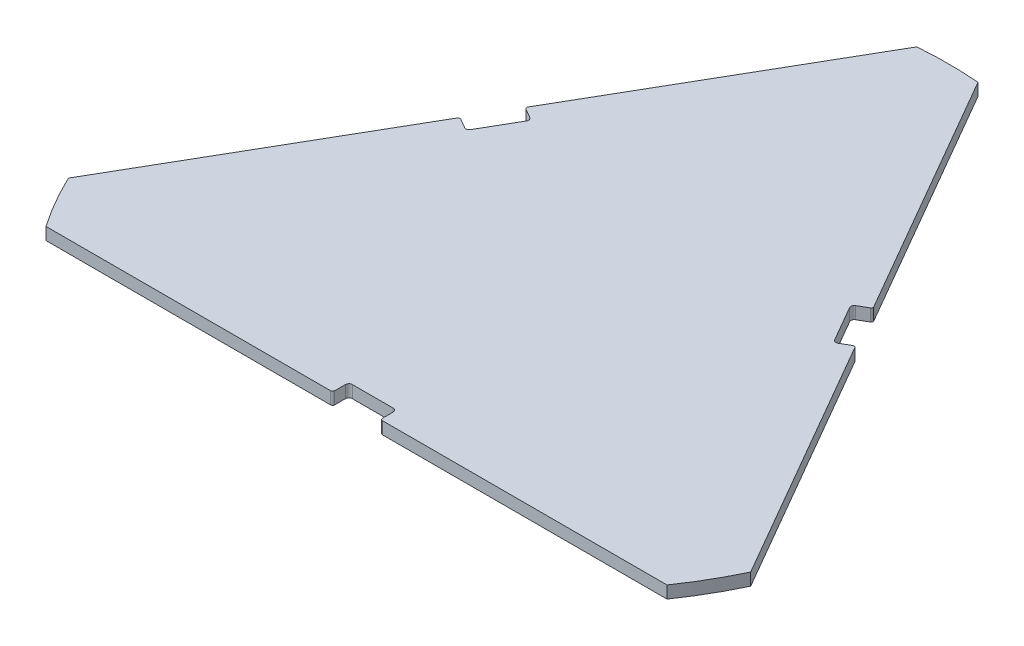
ISO-10303-21;
HEADER;
FILE_DESCRIPTION(('STEP AP214'),'2;1');
FILE_NAME('part.step','',(''),(''),'','','');
FILE_SCHEMA(('AUTOMOTIVE_DESIGN { 1 0 10303 214 1 1 1 1 }'));
ENDSEC;
DATA;
#1=APPLICATION_CONTEXT('core data for automotive mechanical design processes');
#2=APPLICATION_PROTOCOL_DEFINITION('international standard','automotive_design',2000,#1);
#3=PRODUCT_CONTEXT('',#1,'mechanical');
#4=PRODUCT('Part','Part','',(#3));
#5=PRODUCT_RELATED_PRODUCT_CATEGORY('part','',(#4));
#6=PRODUCT_DEFINITION_FORMATION('','',#4);
#7=PRODUCT_DEFINITION_CONTEXT('part definition',#1,'design');
#8=PRODUCT_DEFINITION('design','',#6,#7);
#9=PRODUCT_DEFINITION_SHAPE('','',#8);
#10=(LENGTH_UNIT() NAMED_UNIT(*) SI_UNIT(.MILLI.,.METRE.));
#11=(NAMED_UNIT(*) PLANE_ANGLE_UNIT() SI_UNIT($,.RADIAN.));
#12=(NAMED_UNIT(*) SI_UNIT($,.STERADIAN.) SOLID_ANGLE_UNIT());
#13=UNCERTAINTY_MEASURE_WITH_UNIT(LENGTH_MEASURE(1.E-05),#10,'distance_accuracy_value','');
#14=(GEOMETRIC_REPRESENTATION_CONTEXT(3) GLOBAL_UNCERTAINTY_ASSIGNED_CONTEXT((#13)) GLOBAL_UNIT_ASSIGNED_CONTEXT((#10,
#11,#12)) REPRESENTATION_CONTEXT('',''));
#15=CARTESIAN_POINT('',(0.,0.,0.));
#16=DIRECTION('',(0.,0.,1.));
#17=DIRECTION('',(1.,0.,0.));
#18=AXIS2_PLACEMENT_3D('',#15,#16,#17);
#19=CARTESIAN_POINT('',(-1.86723606306923E-07,18.,-1.07804529192457E-07));
#20=DIRECTION('',(0.,-1.,0.));
#21=DIRECTION('',(0.,0.,-1.));
#22=AXIS2_PLACEMENT_3D('',#19,#20,#21);
#23=CYLINDRICAL_SURFACE('',#22,553.647225230099);
#24=CARTESIAN_POINT('',(-1.86723606306923E-07,0.,-1.07804529192457E-07));
#25=DIRECTION('',(0.,1.,0.));
#26=DIRECTION('',(0.,0.,1.));
#27=AXIS2_PLACEMENT_3D('',#24,#25,#26);
#28=CIRCLE('',#27,553.647225230099);
#29=CARTESIAN_POINT('',(-500.355543515485,0.,237.001224077152));
#30=VERTEX_POINT('',#29);
#31=CARTESIAN_POINT('',(-455.426852277141,0.,314.819999892197));
#32=VERTEX_POINT('',#31);
#33=EDGE_CURVE('E259',#30,#32,#28,.T.);
#34=ORIENTED_EDGE('',*,*,#33,.T.);
#35=DIRECTION('',(0.,-1.,0.));
#36=VECTOR('',#35,1.);
#37=CARTESIAN_POINT('',(-455.426852277141,18.,314.819999892197));
#38=LINE('',#37,#36);
#39=CARTESIAN_POINT('',(-455.426852277141,18.,314.819999892197));
#40=VERTEX_POINT('',#39);
#41=EDGE_CURVE('E240',#40,#32,#38,.T.);
#42=ORIENTED_EDGE('',*,*,#41,.F.);
#43=CARTESIAN_POINT('',(-1.86723606306923E-07,18.,-1.07804529192457E-07));
#44=DIRECTION('',(0.,1.,0.));
#45=DIRECTION('',(0.,0.,1.));
#46=AXIS2_PLACEMENT_3D('',#43,#44,#45);
#47=CIRCLE('',#46,553.647225230099);
#48=CARTESIAN_POINT('',(-500.355543515485,18.,237.001224077152));
#49=VERTEX_POINT('',#48);
#50=EDGE_CURVE('E247',#49,#40,#47,.T.);
#51=ORIENTED_EDGE('',*,*,#50,.F.);
#52=DIRECTION('',(0.,-1.,0.));
#53=VECTOR('',#52,1.);
#54=CARTESIAN_POINT('',(-500.355543515485,18.,237.001224077152));
#55=LINE('',#54,#53);
#56=EDGE_CURVE('E386',#49,#30,#55,.T.);
#57=ORIENTED_EDGE('',*,*,#56,.T.);
#58=EDGE_LOOP('',(#34,#42,#51,#57));
#59=FACE_BOUND('',#58,.T.);
#60=ADVANCED_FACE('F39',(#59),#23,.T.);
#61=CARTESIAN_POINT('',(-455.426852277141,18.,314.819999892197));
#62=DIRECTION('',(0.,0.,-1.));
#63=DIRECTION('',(-1.,0.,0.));
#64=AXIS2_PLACEMENT_3D('',#61,#62,#63);
#65=PLANE('',#64);
#66=DIRECTION('',(1.,0.,0.));
#67=VECTOR('',#66,1.);
#68=CARTESIAN_POINT('',(-455.426852277141,0.,314.819999892197));
#69=LINE('',#68,#67);
#70=CARTESIAN_POINT('',(-38.0000001867224,0.,314.819999892197));
#71=VERTEX_POINT('',#70);
#72=EDGE_CURVE('E433',#32,#71,#69,.T.);
#73=ORIENTED_EDGE('',*,*,#72,.T.);
#74=DIRECTION('',(0.,-1.,0.));
#75=VECTOR('',#74,1.);
#76=CARTESIAN_POINT('',(-38.0000001867224,18.,314.819999892197));
#77=LINE('',#76,#75);
#78=CARTESIAN_POINT('',(-38.0000001867224,18.,314.819999892197));
#79=VERTEX_POINT('',#78);
#80=EDGE_CURVE('E243',#79,#71,#77,.T.);
#81=ORIENTED_EDGE('',*,*,#80,.F.);
#82=DIRECTION('',(1.,0.,0.));
#83=VECTOR('',#82,1.);
#84=CARTESIAN_POINT('',(-455.426852277141,18.,314.819999892197));
#85=LINE('',#84,#83);
#86=EDGE_CURVE('E236',#40,#79,#85,.T.);
#87=ORIENTED_EDGE('',*,*,#86,.F.);
#88=ORIENTED_EDGE('',*,*,#41,.T.);
#89=EDGE_LOOP('',(#73,#81,#87,#88));
#90=FACE_BOUND('',#89,.T.);
#91=ADVANCED_FACE('F238',(#90),#65,.F.);
#92=CARTESIAN_POINT('',(-38.0000001867224,18.,311.819999892197));
#93=DIRECTION('',(0.,-1.,0.));
#94=DIRECTION('',(0.,0.,-1.));
#95=AXIS2_PLACEMENT_3D('',#92,#93,#94);
#96=CYLINDRICAL_SURFACE('',#95,3.00000000000011);
#97=CARTESIAN_POINT('',(-38.0000001867224,0.,311.819999892197));
#98=DIRECTION('',(0.,1.,0.));
#99=DIRECTION('',(0.,0.,1.));
#100=AXIS2_PLACEMENT_3D('',#97,#98,#99);
#101=CIRCLE('',#100,3.00000000000011);
#102=CARTESIAN_POINT('',(-35.0000001867223,0.,311.819999892197));
#103=VERTEX_POINT('',#102);
#104=EDGE_CURVE('E344',#71,#103,#101,.T.);
#105=ORIENTED_EDGE('',*,*,#104,.T.);
#106=DIRECTION('',(0.,-1.,0.));
#107=VECTOR('',#106,1.);
#108=CARTESIAN_POINT('',(-35.0000001867223,18.,311.819999892197));
#109=LINE('',#108,#107);
#110=CARTESIAN_POINT('',(-35.0000001867223,18.,311.819999892197));
#111=VERTEX_POINT('',#110);
#112=EDGE_CURVE('E264',#111,#103,#109,.T.);
#113=ORIENTED_EDGE('',*,*,#112,.F.);
#114=CARTESIAN_POINT('',(-38.0000001867224,18.,311.819999892197));
#115=DIRECTION('',(0.,1.,0.));
#116=DIRECTION('',(0.,0.,1.));
#117=AXIS2_PLACEMENT_3D('',#114,#115,#116);
#118=CIRCLE('',#117,3.00000000000011);
#119=EDGE_CURVE('E246',#79,#111,#118,.T.);
#120=ORIENTED_EDGE('',*,*,#119,.F.);
#121=ORIENTED_EDGE('',*,*,#80,.T.);
#122=EDGE_LOOP('',(#105,#113,#120,#121));
#123=FACE_BOUND('',#122,.T.);
#124=ADVANCED_FACE('F478',(#123),#96,.T.);
#125=CARTESIAN_POINT('',(-35.0000001867223,18.,311.819999892197));
#126=DIRECTION('',(-1.,0.,0.));
#127=DIRECTION('',(0.,0.,1.));
#128=AXIS2_PLACEMENT_3D('',#125,#126,#127);
#129=PLANE('',#128);
#130=DIRECTION('',(0.,0.,-1.));
#131=VECTOR('',#130,1.);
#132=CARTESIAN_POINT('',(-35.0000001867223,0.,311.819999892197));
#133=LINE('',#132,#131);
#134=CARTESIAN_POINT('',(-35.0000001867223,0.,295.999999892197));
#135=VERTEX_POINT('',#134);
#136=EDGE_CURVE('E340',#103,#135,#133,.T.);
#137=ORIENTED_EDGE('',*,*,#136,.T.);
#138=DIRECTION('',(0.,-1.,0.));
#139=VECTOR('',#138,1.);
#140=CARTESIAN_POINT('',(-35.0000001867223,18.,295.999999892197));
#141=LINE('',#140,#139);
#142=CARTESIAN_POINT('',(-35.0000001867223,18.,295.999999892197));
#143=VERTEX_POINT('',#142);
#144=EDGE_CURVE('E54',#135,#143,#141,.F.);
#145=ORIENTED_EDGE('',*,*,#144,.T.);
#146=DIRECTION('',(0.,0.,-1.));
#147=VECTOR('',#146,1.);
#148=CARTESIAN_POINT('',(-35.0000001867223,18.,311.819999892197));
#149=LINE('',#148,#147);
#150=EDGE_CURVE('E430',#111,#143,#149,.T.);
#151=ORIENTED_EDGE('',*,*,#150,.F.);
#152=ORIENTED_EDGE('',*,*,#112,.T.);
#153=EDGE_LOOP('',(#137,#145,#151,#152));
#154=FACE_BOUND('',#153,.T.);
#155=ADVANCED_FACE('F429',(#154),#129,.F.);
#156=CARTESIAN_POINT('',(-35.0000001867223,18.,290.999999892197));
#157=DIRECTION('',(0.,0.,-1.));
#158=DIRECTION('',(-1.,0.,0.));
#159=AXIS2_PLACEMENT_3D('',#156,#157,#158);
#160=PLANE('',#159);
#161=DIRECTION('',(1.,0.,0.));
#162=VECTOR('',#161,1.);
#163=CARTESIAN_POINT('',(-35.0000001867223,0.,290.999999892197));
#164=LINE('',#163,#162);
#165=CARTESIAN_POINT('',(-30.0000001867223,0.,290.999999892197));
#166=VERTEX_POINT('',#165);
#167=CARTESIAN_POINT('',(29.9999998132779,0.,290.999999892197));
#168=VERTEX_POINT('',#167);
#169=EDGE_CURVE('E334',#166,#168,#164,.T.);
#170=ORIENTED_EDGE('',*,*,#169,.T.);
#171=DIRECTION('',(0.,-1.,0.));
#172=VECTOR('',#171,1.);
#173=CARTESIAN_POINT('',(29.9999998132779,18.,290.999999892197));
#174=LINE('',#173,#172);
#175=CARTESIAN_POINT('',(29.9999998132779,18.,290.999999892197));
#176=VERTEX_POINT('',#175);
#177=EDGE_CURVE('E291',#168,#176,#174,.F.);
#178=ORIENTED_EDGE('',*,*,#177,.T.);
#179=DIRECTION('',(1.,0.,0.));
#180=VECTOR('',#179,1.);
#181=CARTESIAN_POINT('',(-35.0000001867223,18.,290.999999892197));
#182=LINE('',#181,#180);
#183=CARTESIAN_POINT('',(-30.0000001867223,18.,290.999999892197));
#184=VERTEX_POINT('',#183);
#185=EDGE_CURVE('E319',#184,#176,#182,.T.);
#186=ORIENTED_EDGE('',*,*,#185,.F.);
#187=DIRECTION('',(0.,-1.,0.));
#188=VECTOR('',#187,1.);
#189=CARTESIAN_POINT('',(-30.0000001867223,0.,290.999999892197));
#190=LINE('',#189,#188);
#191=EDGE_CURVE('E288',#184,#166,#190,.T.);
#192=ORIENTED_EDGE('',*,*,#191,.T.);
#193=EDGE_LOOP('',(#170,#178,#186,#192));
#194=FACE_BOUND('',#193,.T.);
#195=ADVANCED_FACE('F338',(#194),#160,.F.);
#196=CARTESIAN_POINT('',(34.9999998132779,18.,290.999999892197));
#197=DIRECTION('',(1.,0.,0.));
#198=DIRECTION('',(0.,0.,-1.));
#199=AXIS2_PLACEMENT_3D('',#196,#197,#198);
#200=PLANE('',#199);
#201=DIRECTION('',(0.,0.,1.));
#202=VECTOR('',#201,1.);
#203=CARTESIAN_POINT('',(34.9999998132779,18.,290.999999892197));
#204=LINE('',#203,#202);
#205=CARTESIAN_POINT('',(34.9999998132779,18.,295.999999892197));
#206=VERTEX_POINT('',#205);
#207=CARTESIAN_POINT('',(34.9999998132779,18.,311.819999892198));
#208=VERTEX_POINT('',#207);
#209=EDGE_CURVE('E316',#206,#208,#204,.T.);
#210=ORIENTED_EDGE('',*,*,#209,.F.);
#211=DIRECTION('',(0.,-1.,0.));
#212=VECTOR('',#211,1.);
#213=CARTESIAN_POINT('',(34.9999998132779,0.,295.999999892197));
#214=LINE('',#213,#212);
#215=CARTESIAN_POINT('',(34.9999998132779,0.,295.999999892197));
#216=VERTEX_POINT('',#215);
#217=EDGE_CURVE('E285',#206,#216,#214,.T.);
#218=ORIENTED_EDGE('',*,*,#217,.T.);
#219=DIRECTION('',(0.,0.,1.));
#220=VECTOR('',#219,1.);
#221=CARTESIAN_POINT('',(34.9999998132779,0.,290.999999892197));
#222=LINE('',#221,#220);
#223=CARTESIAN_POINT('',(34.9999998132779,0.,311.819999892198));
#224=VERTEX_POINT('',#223);
#225=EDGE_CURVE('E336',#216,#224,#222,.T.);
#226=ORIENTED_EDGE('',*,*,#225,.T.);
#227=DIRECTION('',(0.,-1.,0.));
#228=VECTOR('',#227,1.);
#229=CARTESIAN_POINT('',(34.9999998132779,18.,311.819999892198));
#230=LINE('',#229,#228);
#231=EDGE_CURVE('E327',#208,#224,#230,.T.);
#232=ORIENTED_EDGE('',*,*,#231,.F.);
#233=EDGE_LOOP('',(#210,#218,#226,#232));
#234=FACE_BOUND('',#233,.T.);
#235=ADVANCED_FACE('F324',(#234),#200,.F.);
#236=CARTESIAN_POINT('',(37.999999813278,18.,311.819999892198));
#237=DIRECTION('',(0.,-1.,0.));
#238=DIRECTION('',(0.,0.,-1.));
#239=AXIS2_PLACEMENT_3D('',#236,#237,#238);
#240=CYLINDRICAL_SURFACE('',#239,3.00000000000011);
#241=CARTESIAN_POINT('',(37.999999813278,0.,311.819999892198));
#242=DIRECTION('',(0.,1.,0.));
#243=DIRECTION('',(0.,0.,1.));
#244=AXIS2_PLACEMENT_3D('',#241,#242,#243);
#245=CIRCLE('',#244,3.00000000000011);
#246=CARTESIAN_POINT('',(37.999999813278,0.,314.819999892198));
#247=VERTEX_POINT('',#246);
#248=EDGE_CURVE('E342',#224,#247,#245,.T.);
#249=ORIENTED_EDGE('',*,*,#248,.T.);
#250=DIRECTION('',(0.,-1.,0.));
#251=VECTOR('',#250,1.);
#252=CARTESIAN_POINT('',(37.999999813278,18.,314.819999892198));
#253=LINE('',#252,#251);
#254=CARTESIAN_POINT('',(37.999999813278,18.,314.819999892198));
#255=VERTEX_POINT('',#254);
#256=EDGE_CURVE('E424',#255,#247,#253,.T.);
#257=ORIENTED_EDGE('',*,*,#256,.F.);
#258=CARTESIAN_POINT('',(37.999999813278,18.,311.819999892198));
#259=DIRECTION('',(0.,1.,0.));
#260=DIRECTION('',(0.,0.,1.));
#261=AXIS2_PLACEMENT_3D('',#258,#259,#260);
#262=CIRCLE('',#261,3.00000000000011);
#263=EDGE_CURVE('E329',#208,#255,#262,.T.);
#264=ORIENTED_EDGE('',*,*,#263,.F.);
#265=ORIENTED_EDGE('',*,*,#231,.T.);
#266=EDGE_LOOP('',(#249,#257,#264,#265));
#267=FACE_BOUND('',#266,.T.);
#268=ADVANCED_FACE('F643',(#267),#240,.T.);
#269=CARTESIAN_POINT('',(37.999999813278,18.,314.819999892198));
#270=DIRECTION('',(0.,0.,-1.));
#271=DIRECTION('',(-1.,0.,0.));
#272=AXIS2_PLACEMENT_3D('',#269,#270,#271);
#273=PLANE('',#272);
#274=DIRECTION('',(1.,0.,0.));
#275=VECTOR('',#274,1.);
#276=CARTESIAN_POINT('',(37.999999813278,0.,314.819999892198));
#277=LINE('',#276,#275);
#278=CARTESIAN_POINT('',(455.426851903696,0.,314.819999892198));
#279=VERTEX_POINT('',#278);
#280=EDGE_CURVE('E349',#247,#279,#277,.T.);
#281=ORIENTED_EDGE('',*,*,#280,.T.);
#282=DIRECTION('',(0.,-1.,0.));
#283=VECTOR('',#282,1.);
#284=CARTESIAN_POINT('',(455.426851903696,18.,314.819999892198));
#285=LINE('',#284,#283);
#286=CARTESIAN_POINT('',(455.426851903696,18.,314.819999892198));
#287=VERTEX_POINT('',#286);
#288=EDGE_CURVE('E421',#287,#279,#285,.T.);
#289=ORIENTED_EDGE('',*,*,#288,.F.);
#290=DIRECTION('',(1.,0.,0.));
#291=VECTOR('',#290,1.);
#292=CARTESIAN_POINT('',(37.999999813278,18.,314.819999892198));
#293=LINE('',#292,#291);
#294=EDGE_CURVE('E472',#255,#287,#293,.T.);
#295=ORIENTED_EDGE('',*,*,#294,.F.);
#296=ORIENTED_EDGE('',*,*,#256,.T.);
#297=EDGE_LOOP('',(#281,#289,#295,#296));
#298=FACE_BOUND('',#297,.T.);
#299=ADVANCED_FACE('F746',(#298),#273,.F.);
#300=CARTESIAN_POINT('',(-1.86723606306923E-07,18.,-1.07804529192457E-07));
#301=DIRECTION('',(0.,-1.,0.));
#302=DIRECTION('',(0.,0.,-1.));
#303=AXIS2_PLACEMENT_3D('',#300,#301,#302);
#304=CYLINDRICAL_SURFACE('',#303,553.647225230101);
#305=CARTESIAN_POINT('',(-1.86723606306923E-07,0.,-1.07804529192457E-07));
#306=DIRECTION('',(0.,1.,0.));
#307=DIRECTION('',(0.,0.,1.));
#308=AXIS2_PLACEMENT_3D('',#305,#306,#307);
#309=CIRCLE('',#308,553.647225230101);
#310=CARTESIAN_POINT('',(500.355543579487,0.,237.001223153615));
#311=VERTEX_POINT('',#310);
#312=EDGE_CURVE('E351',#279,#311,#309,.T.);
#313=ORIENTED_EDGE('',*,*,#312,.T.);
#314=DIRECTION('',(0.,-1.,0.));
#315=VECTOR('',#314,1.);
#316=CARTESIAN_POINT('',(500.355543579487,18.,237.001223153615));
#317=LINE('',#316,#315);
#318=CARTESIAN_POINT('',(500.355543579487,18.,237.001223153615));
#319=VERTEX_POINT('',#318);
#320=EDGE_CURVE('E418',#319,#311,#317,.T.);
#321=ORIENTED_EDGE('',*,*,#320,.F.);
#322=CARTESIAN_POINT('',(-1.86723606306923E-07,18.,-1.07804529192457E-07));
#323=DIRECTION('',(0.,1.,0.));
#324=DIRECTION('',(0.,0.,1.));
#325=AXIS2_PLACEMENT_3D('',#322,#323,#324);
#326=CIRCLE('',#325,553.647225230101);
#327=EDGE_CURVE('E470',#287,#319,#326,.T.);
#328=ORIENTED_EDGE('',*,*,#327,.F.);
#329=ORIENTED_EDGE('',*,*,#288,.T.);
#330=EDGE_LOOP('',(#313,#321,#328,#329));
#331=FACE_BOUND('',#330,.T.);
#332=ADVANCED_FACE('F736',(#331),#304,.T.);
#333=CARTESIAN_POINT('',(500.355543579487,18.,237.001223153615));
#334=DIRECTION('',(-0.866025403784439,0.,0.5));
#335=DIRECTION('',(0.5,0.,0.866025403784439));
#336=AXIS2_PLACEMENT_3D('',#333,#334,#335);
#337=PLANE('',#336);
#338=DIRECTION('',(-0.5,0.,-0.866025403784439));
#339=VECTOR('',#338,1.);
#340=CARTESIAN_POINT('',(500.355543579487,0.,237.001223153615));
#341=LINE('',#340,#339);
#342=CARTESIAN_POINT('',(291.642117601455,0.,-124.501034862104));
#343=VERTEX_POINT('',#342);
#344=EDGE_CURVE('E353',#311,#343,#341,.T.);
#345=ORIENTED_EDGE('',*,*,#344,.T.);
#346=DIRECTION('',(0.,-1.,0.));
#347=VECTOR('',#346,1.);
#348=CARTESIAN_POINT('',(291.642117601455,18.,-124.501034862104));
#349=LINE('',#348,#347);
#350=CARTESIAN_POINT('',(291.642117601455,18.,-124.501034862104));
#351=VERTEX_POINT('',#350);
#352=EDGE_CURVE('E415',#351,#343,#349,.T.);
#353=ORIENTED_EDGE('',*,*,#352,.F.);
#354=DIRECTION('',(-0.5,0.,-0.866025403784439));
#355=VECTOR('',#354,1.);
#356=CARTESIAN_POINT('',(500.355543579487,18.,237.001223153615));
#357=LINE('',#356,#355);
#358=EDGE_CURVE('E468',#319,#351,#357,.T.);
#359=ORIENTED_EDGE('',*,*,#358,.F.);
#360=ORIENTED_EDGE('',*,*,#320,.T.);
#361=EDGE_LOOP('',(#345,#353,#359,#360));
#362=FACE_BOUND('',#361,.T.);
#363=ADVANCED_FACE('F726',(#362),#337,.F.);
#364=CARTESIAN_POINT('',(289.044041390393,18.,-123.001034861597));
#365=DIRECTION('',(0.,-1.,0.));
#366=DIRECTION('',(0.,0.,-1.));
#367=AXIS2_PLACEMENT_3D('',#364,#365,#366);
#368=CYLINDRICAL_SURFACE('',#367,3.00000000000039);
#369=CARTESIAN_POINT('',(289.044041390393,0.,-123.001034861597));
#370=DIRECTION('',(0.,1.,0.));
#371=DIRECTION('',(0.,0.,1.));
#372=AXIS2_PLACEMENT_3D('',#369,#370,#371);
#373=CIRCLE('',#372,3.00000000000039);
#374=CARTESIAN_POINT('',(287.544041390393,0.,-125.599111072951));
#375=VERTEX_POINT('',#374);
#376=EDGE_CURVE('E355',#343,#375,#373,.T.);
#377=ORIENTED_EDGE('',*,*,#376,.T.);
#378=DIRECTION('',(0.,-1.,0.));
#379=VECTOR('',#378,1.);
#380=CARTESIAN_POINT('',(287.544041390393,18.,-125.599111072951));
#381=LINE('',#380,#379);
#382=CARTESIAN_POINT('',(287.544041390393,18.,-125.599111072951));
#383=VERTEX_POINT('',#382);
#384=EDGE_CURVE('E412',#383,#375,#381,.T.);
#385=ORIENTED_EDGE('',*,*,#384,.F.);
#386=CARTESIAN_POINT('',(289.044041390393,18.,-123.001034861597));
#387=DIRECTION('',(0.,1.,0.));
#388=DIRECTION('',(0.,0.,1.));
#389=AXIS2_PLACEMENT_3D('',#386,#387,#388);
#390=CIRCLE('',#389,3.00000000000039);
#391=EDGE_CURVE('E466',#351,#383,#390,.T.);
#392=ORIENTED_EDGE('',*,*,#391,.F.);
#393=ORIENTED_EDGE('',*,*,#352,.T.);
#394=EDGE_LOOP('',(#377,#385,#392,#393));
#395=FACE_BOUND('',#394,.T.);
#396=ADVANCED_FACE('F631',(#395),#368,.T.);
#397=CARTESIAN_POINT('',(287.544041390393,18.,-125.599111072951));
#398=DIRECTION('',(0.5,0.,0.866025403784439));
#399=DIRECTION('',(0.866025403784439,0.,-0.5));
#400=AXIS2_PLACEMENT_3D('',#397,#398,#399);
#401=PLANE('',#400);
#402=DIRECTION('',(-0.866025403784439,0.,0.5));
#403=VECTOR('',#402,1.);
#404=CARTESIAN_POINT('',(287.544041390393,0.,-125.599111072951));
#405=LINE('',#404,#403);
#406=CARTESIAN_POINT('',(273.843519262953,0.,-117.689110934635));
#407=VERTEX_POINT('',#406);
#408=EDGE_CURVE('E357',#375,#407,#405,.T.);
#409=ORIENTED_EDGE('',*,*,#408,.T.);
#410=DIRECTION('',(0.,-1.,0.));
#411=VECTOR('',#410,1.);
#412=CARTESIAN_POINT('',(273.843519262953,18.,-117.689110934635));
#413=LINE('',#412,#411);
#414=CARTESIAN_POINT('',(273.843519262953,18.,-117.689110934635));
#415=VERTEX_POINT('',#414);
#416=EDGE_CURVE('E280',#407,#415,#413,.F.);
#417=ORIENTED_EDGE('',*,*,#416,.T.);
#418=DIRECTION('',(-0.866025403784439,0.,0.5));
#419=VECTOR('',#418,1.);
#420=CARTESIAN_POINT('',(287.544041390393,18.,-125.599111072951));
#421=LINE('',#420,#419);
#422=EDGE_CURVE('E463',#383,#415,#421,.T.);
#423=ORIENTED_EDGE('',*,*,#422,.F.);
#424=ORIENTED_EDGE('',*,*,#384,.T.);
#425=EDGE_LOOP('',(#409,#417,#423,#424));
#426=FACE_BOUND('',#425,.T.);
#427=ADVANCED_FACE('F621',(#426),#401,.F.);
#428=CARTESIAN_POINT('',(269.513392244031,18.,-115.189110934635));
#429=DIRECTION('',(-0.866025403784439,0.,0.5));
#430=DIRECTION('',(0.5,0.,0.866025403784439));
#431=AXIS2_PLACEMENT_3D('',#428,#429,#430);
#432=PLANE('',#431);
#433=DIRECTION('',(-0.5,0.,-0.866025403784439));
#434=VECTOR('',#433,1.);
#435=CARTESIAN_POINT('',(269.513392244031,18.,-115.189110934635));
#436=LINE('',#435,#434);
#437=CARTESIAN_POINT('',(267.013392244031,18.,-119.519237953557));
#438=VERTEX_POINT('',#437);
#439=CARTESIAN_POINT('',(237.013392244032,18.,-171.480762180622));
#440=VERTEX_POINT('',#439);
#441=EDGE_CURVE('E460',#438,#440,#436,.T.);
#442=ORIENTED_EDGE('',*,*,#441,.F.);
#443=DIRECTION('',(0.,-1.,0.));
#444=VECTOR('',#443,1.);
#445=CARTESIAN_POINT('',(267.013392244031,0.,-119.519237953557));
#446=LINE('',#445,#444);
#447=CARTESIAN_POINT('',(267.013392244031,0.,-119.519237953557));
#448=VERTEX_POINT('',#447);
#449=EDGE_CURVE('E277',#438,#448,#446,.T.);
#450=ORIENTED_EDGE('',*,*,#449,.T.);
#451=DIRECTION('',(-0.5,0.,-0.866025403784439));
#452=VECTOR('',#451,1.);
#453=CARTESIAN_POINT('',(269.513392244031,0.,-115.189110934635));
#454=LINE('',#453,#452);
#455=CARTESIAN_POINT('',(237.013392244032,0.,-171.480762180622));
#456=VERTEX_POINT('',#455);
#457=EDGE_CURVE('E360',#448,#456,#454,.T.);
#458=ORIENTED_EDGE('',*,*,#457,.T.);
#459=DIRECTION('',(0.,-1.,0.));
#460=VECTOR('',#459,1.);
#461=CARTESIAN_POINT('',(237.013392244032,18.,-171.480762180622));
#462=LINE('',#461,#460);
#463=EDGE_CURVE('E275',#456,#440,#462,.F.);
#464=ORIENTED_EDGE('',*,*,#463,.T.);
#465=EDGE_LOOP('',(#442,#450,#458,#464));
#466=FACE_BOUND('',#465,.T.);
#467=ADVANCED_FACE('F609',(#466),#432,.F.);
#468=CARTESIAN_POINT('',(234.513392244032,18.,-175.810889199544));
#469=DIRECTION('',(-0.5,0.,-0.866025403784439));
#470=DIRECTION('',(-0.866025403784439,0.,0.5));
#471=AXIS2_PLACEMENT_3D('',#468,#469,#470);
#472=PLANE('',#471);
#473=DIRECTION('',(0.866025403784439,0.,-0.5));
#474=VECTOR('',#473,1.);
#475=CARTESIAN_POINT('',(234.513392244032,18.,-175.810889199544));
#476=LINE('',#475,#474);
#477=CARTESIAN_POINT('',(238.843519262954,18.,-178.310889199544));
#478=VERTEX_POINT('',#477);
#479=CARTESIAN_POINT('',(252.544041236522,18.,-186.220889249022));
#480=VERTEX_POINT('',#479);
#481=EDGE_CURVE('E458',#478,#480,#476,.T.);
#482=ORIENTED_EDGE('',*,*,#481,.F.);
#483=DIRECTION('',(0.,-1.,0.));
#484=VECTOR('',#483,1.);
#485=CARTESIAN_POINT('',(238.843519262954,0.,-178.310889199544));
#486=LINE('',#485,#484);
#487=CARTESIAN_POINT('',(238.843519262954,0.,-178.310889199544));
#488=VERTEX_POINT('',#487);
#489=EDGE_CURVE('E282',#478,#488,#486,.T.);
#490=ORIENTED_EDGE('',*,*,#489,.T.);
#491=DIRECTION('',(0.866025403784439,0.,-0.5));
#492=VECTOR('',#491,1.);
#493=CARTESIAN_POINT('',(234.513392244032,0.,-175.810889199544));
#494=LINE('',#493,#492);
#495=CARTESIAN_POINT('',(252.544041236522,0.,-186.220889249022));
#496=VERTEX_POINT('',#495);
#497=EDGE_CURVE('E363',#488,#496,#494,.T.);
#498=ORIENTED_EDGE('',*,*,#497,.T.);
#499=DIRECTION('',(0.,-1.,0.));
#500=VECTOR('',#499,1.);
#501=CARTESIAN_POINT('',(252.544041236522,18.,-186.220889249022));
#502=LINE('',#501,#500);
#503=EDGE_CURVE('E409',#480,#496,#502,.T.);
#504=ORIENTED_EDGE('',*,*,#503,.F.);
#505=EDGE_LOOP('',(#482,#490,#498,#504));
#506=FACE_BOUND('',#505,.T.);
#507=ADVANCED_FACE('F603',(#506),#472,.F.);
#508=CARTESIAN_POINT('',(251.04404123652,18.,-188.818965460375));
#509=DIRECTION('',(0.,-1.,0.));
#510=DIRECTION('',(0.,0.,-1.));
#511=AXIS2_PLACEMENT_3D('',#508,#509,#510);
#512=CYLINDRICAL_SURFACE('',#511,3.00000000000051);
#513=CARTESIAN_POINT('',(251.04404123652,0.,-188.818965460375));
#514=DIRECTION('',(0.,1.,0.));
#515=DIRECTION('',(0.,0.,1.));
#516=AXIS2_PLACEMENT_3D('',#513,#514,#515);
#517=CIRCLE('',#516,3.00000000000051);
#518=CARTESIAN_POINT('',(253.642117447582,0.,-190.318965460882));
#519=VERTEX_POINT('',#518);
#520=EDGE_CURVE('E365',#496,#519,#517,.T.);
#521=ORIENTED_EDGE('',*,*,#520,.T.);
#522=DIRECTION('',(0.,-1.,0.));
#523=VECTOR('',#522,1.);
#524=CARTESIAN_POINT('',(253.642117447582,18.,-190.318965460882));
#525=LINE('',#524,#523);
#526=CARTESIAN_POINT('',(253.642117447582,18.,-190.318965460882));
#527=VERTEX_POINT('',#526);
#528=EDGE_CURVE('E406',#527,#519,#525,.T.);
#529=ORIENTED_EDGE('',*,*,#528,.F.);
#530=CARTESIAN_POINT('',(251.04404123652,18.,-188.818965460375));
#531=DIRECTION('',(0.,1.,0.));
#532=DIRECTION('',(0.,0.,1.));
#533=AXIS2_PLACEMENT_3D('',#530,#531,#532);
#534=CIRCLE('',#533,3.00000000000051);
#535=EDGE_CURVE('E456',#480,#527,#534,.T.);
#536=ORIENTED_EDGE('',*,*,#535,.F.);
#537=ORIENTED_EDGE('',*,*,#503,.T.);
#538=EDGE_LOOP('',(#521,#529,#536,#537));
#539=FACE_BOUND('',#538,.T.);
#540=ADVANCED_FACE('F608',(#539),#512,.T.);
#541=CARTESIAN_POINT('',(253.642117447582,18.,-190.318965460882));
#542=DIRECTION('',(-0.866025403784439,0.,0.5));
#543=DIRECTION('',(0.5,0.,0.866025403784439));
#544=AXIS2_PLACEMENT_3D('',#541,#542,#543);
#545=PLANE('',#544);
#546=DIRECTION('',(-0.5,0.,-0.866025403784439));
#547=VECTOR('',#546,1.);
#548=CARTESIAN_POINT('',(253.642117447582,0.,-190.318965460882));
#549=LINE('',#548,#547);
#550=CARTESIAN_POINT('',(44.9286914087227,0.,-551.821223581955));
#551=VERTEX_POINT('',#550);
#552=EDGE_CURVE('E367',#519,#551,#549,.T.);
#553=ORIENTED_EDGE('',*,*,#552,.T.);
#554=DIRECTION('',(0.,-1.,0.));
#555=VECTOR('',#554,1.);
#556=CARTESIAN_POINT('',(44.9286914087227,18.,-551.821223581955));
#557=LINE('',#556,#555);
#558=CARTESIAN_POINT('',(44.9286914087227,18.,-551.821223581955));
#559=VERTEX_POINT('',#558);
#560=EDGE_CURVE('E403',#559,#551,#557,.T.);
#561=ORIENTED_EDGE('',*,*,#560,.F.);
#562=DIRECTION('',(-0.5,0.,-0.866025403784439));
#563=VECTOR('',#562,1.);
#564=CARTESIAN_POINT('',(253.642117447582,18.,-190.318965460882));
#565=LINE('',#564,#563);
#566=EDGE_CURVE('E454',#527,#559,#565,.T.);
#567=ORIENTED_EDGE('',*,*,#566,.F.);
#568=ORIENTED_EDGE('',*,*,#528,.T.);
#569=EDGE_LOOP('',(#553,#561,#567,#568));
#570=FACE_BOUND('',#569,.T.);
#571=ADVANCED_FACE('F702',(#570),#545,.F.);
#572=CARTESIAN_POINT('',(-1.86723606306923E-07,18.,-1.07804529192457E-07));
#573=DIRECTION('',(0.,-1.,0.));
#574=DIRECTION('',(0.,0.,-1.));
#575=AXIS2_PLACEMENT_3D('',#572,#573,#574);
#576=CYLINDRICAL_SURFACE('',#575,553.647225230098);
#577=CARTESIAN_POINT('',(-1.86723606306923E-07,0.,-1.07804529192457E-07));
#578=DIRECTION('',(0.,1.,0.));
#579=DIRECTION('',(0.,0.,1.));
#580=AXIS2_PLACEMENT_3D('',#577,#578,#579);
#581=CIRCLE('',#580,553.647225230098);
#582=CARTESIAN_POINT('',(-44.9286915489678,0.,-551.821223600942));
#583=VERTEX_POINT('',#582);
#584=EDGE_CURVE('E369',#551,#583,#581,.T.);
#585=ORIENTED_EDGE('',*,*,#584,.T.);
#586=DIRECTION('',(0.,-1.,0.));
#587=VECTOR('',#586,1.);
#588=CARTESIAN_POINT('',(-44.9286915489678,18.,-551.821223600942));
#589=LINE('',#588,#587);
#590=CARTESIAN_POINT('',(-44.9286915489678,18.,-551.821223600942));
#591=VERTEX_POINT('',#590);
#592=EDGE_CURVE('E400',#591,#583,#589,.T.);
#593=ORIENTED_EDGE('',*,*,#592,.F.);
#594=CARTESIAN_POINT('',(-1.86723606306923E-07,18.,-1.07804529192457E-07));
#595=DIRECTION('',(0.,1.,0.));
#596=DIRECTION('',(0.,0.,1.));
#597=AXIS2_PLACEMENT_3D('',#594,#595,#596);
#598=CIRCLE('',#597,553.647225230098);
#599=EDGE_CURVE('E452',#559,#591,#598,.T.);
#600=ORIENTED_EDGE('',*,*,#599,.F.);
#601=ORIENTED_EDGE('',*,*,#560,.T.);
#602=EDGE_LOOP('',(#585,#593,#600,#601));
#603=FACE_BOUND('',#602,.T.);
#604=ADVANCED_FACE('F692',(#603),#576,.T.);
#605=CARTESIAN_POINT('',(-44.9286915489681,18.,-551.821223600941));
#606=DIRECTION('',(0.866025403784439,0.,0.5));
#607=DIRECTION('',(0.5,0.,-0.866025403784439));
#608=AXIS2_PLACEMENT_3D('',#605,#606,#607);
#609=PLANE('',#608);
#610=DIRECTION('',(-0.5,0.,0.866025403784439));
#611=VECTOR('',#610,1.);
#612=CARTESIAN_POINT('',(-44.9286915489681,0.,-551.821223600941));
#613=LINE('',#612,#611);
#614=CARTESIAN_POINT('',(-253.642117655415,0.,-190.318965362802));
#615=VERTEX_POINT('',#614);
#616=EDGE_CURVE('E371',#583,#615,#613,.T.);
#617=ORIENTED_EDGE('',*,*,#616,.T.);
#618=DIRECTION('',(0.,-1.,0.));
#619=VECTOR('',#618,1.);
#620=CARTESIAN_POINT('',(-253.642117655415,18.,-190.318965362802));
#621=LINE('',#620,#619);
#622=CARTESIAN_POINT('',(-253.642117655415,18.,-190.318965362802));
#623=VERTEX_POINT('',#622);
#624=EDGE_CURVE('E397',#623,#615,#621,.T.);
#625=ORIENTED_EDGE('',*,*,#624,.F.);
#626=DIRECTION('',(-0.5,0.,0.866025403784439));
#627=VECTOR('',#626,1.);
#628=CARTESIAN_POINT('',(-44.9286915489681,18.,-551.821223600941));
#629=LINE('',#628,#627);
#630=EDGE_CURVE('E450',#591,#623,#629,.T.);
#631=ORIENTED_EDGE('',*,*,#630,.F.);
#632=ORIENTED_EDGE('',*,*,#592,.T.);
#633=EDGE_LOOP('',(#617,#625,#631,#632));
#634=FACE_BOUND('',#633,.T.);
#635=ADVANCED_FACE('F682',(#634),#609,.F.);
#636=CARTESIAN_POINT('',(-251.044041443288,18.,-188.818965364144));
#637=DIRECTION('',(0.,-1.,0.));
#638=DIRECTION('',(0.,0.,-1.));
#639=AXIS2_PLACEMENT_3D('',#636,#637,#638);
#640=CYLINDRICAL_SURFACE('',#639,2.99999999999929);
#641=CARTESIAN_POINT('',(-251.044041443288,0.,-188.818965364144));
#642=DIRECTION('',(0.,1.,0.));
#643=DIRECTION('',(0.,0.,1.));
#644=AXIS2_PLACEMENT_3D('',#641,#642,#643);
#645=CIRCLE('',#644,2.99999999999929);
#646=CARTESIAN_POINT('',(-252.544041443287,0.,-186.220889152791));
#647=VERTEX_POINT('',#646);
#648=EDGE_CURVE('E373',#615,#647,#645,.T.);
#649=ORIENTED_EDGE('',*,*,#648,.T.);
#650=DIRECTION('',(0.,-1.,0.));
#651=VECTOR('',#650,1.);
#652=CARTESIAN_POINT('',(-252.544041443287,18.,-186.220889152791));
#653=LINE('',#652,#651);
#654=CARTESIAN_POINT('',(-252.544041443287,18.,-186.220889152791));
#655=VERTEX_POINT('',#654);
#656=EDGE_CURVE('E394',#655,#647,#653,.T.);
#657=ORIENTED_EDGE('',*,*,#656,.F.);
#658=CARTESIAN_POINT('',(-251.044041443288,18.,-188.818965364144));
#659=DIRECTION('',(0.,1.,0.));
#660=DIRECTION('',(0.,0.,1.));
#661=AXIS2_PLACEMENT_3D('',#658,#659,#660);
#662=CIRCLE('',#661,2.99999999999929);
#663=EDGE_CURVE('E448',#623,#655,#662,.T.);
#664=ORIENTED_EDGE('',*,*,#663,.F.);
#665=ORIENTED_EDGE('',*,*,#624,.T.);
#666=EDGE_LOOP('',(#649,#657,#664,#665));
#667=FACE_BOUND('',#666,.T.);
#668=ADVANCED_FACE('F595',(#667),#640,.T.);
#669=CARTESIAN_POINT('',(-252.544041443287,18.,-186.220889152791));
#670=DIRECTION('',(0.499999999999991,0.,-0.866025403784444));
#671=DIRECTION('',(-0.866025403784444,0.,-0.499999999999991));
#672=AXIS2_PLACEMENT_3D('',#669,#670,#671);
#673=PLANE('',#672);
#674=DIRECTION('',(0.866025403784444,0.,0.499999999999991));
#675=VECTOR('',#674,1.);
#676=CARTESIAN_POINT('',(-252.544041443287,0.,-186.220889152791));
#677=LINE('',#676,#675);
#678=CARTESIAN_POINT('',(-238.843519520193,0.,-178.310889132454));
#679=VERTEX_POINT('',#678);
#680=EDGE_CURVE('E375',#647,#679,#677,.T.);
#681=ORIENTED_EDGE('',*,*,#680,.T.);
#682=DIRECTION('',(0.,-1.,0.));
#683=VECTOR('',#682,1.);
#684=CARTESIAN_POINT('',(-238.843519520193,18.,-178.310889132454));
#685=LINE('',#684,#683);
#686=CARTESIAN_POINT('',(-238.843519520193,18.,-178.310889132454));
#687=VERTEX_POINT('',#686);
#688=EDGE_CURVE('E270',#679,#687,#685,.F.);
#689=ORIENTED_EDGE('',*,*,#688,.T.);
#690=DIRECTION('',(0.866025403784444,0.,0.499999999999991));
#691=VECTOR('',#690,1.);
#692=CARTESIAN_POINT('',(-252.544041443287,18.,-186.220889152791));
#693=LINE('',#692,#691);
#694=EDGE_CURVE('E445',#655,#687,#693,.T.);
#695=ORIENTED_EDGE('',*,*,#694,.F.);
#696=ORIENTED_EDGE('',*,*,#656,.T.);
#697=EDGE_LOOP('',(#681,#689,#695,#696));
#698=FACE_BOUND('',#697,.T.);
#699=ADVANCED_FACE('F585',(#698),#673,.F.);
#700=CARTESIAN_POINT('',(-234.51339250127,18.,-175.810889132454));
#701=DIRECTION('',(0.866025403784437,0.,0.500000000000003));
#702=DIRECTION('',(0.500000000000003,0.,-0.866025403784437));
#703=AXIS2_PLACEMENT_3D('',#700,#701,#702);
#704=PLANE('',#703);
#705=DIRECTION('',(-0.500000000000003,0.,0.866025403784437));
#706=VECTOR('',#705,1.);
#707=CARTESIAN_POINT('',(-234.51339250127,18.,-175.810889132454));
#708=LINE('',#707,#706);
#709=CARTESIAN_POINT('',(-237.01339250127,18.,-171.480762113532));
#710=VERTEX_POINT('',#709);
#711=CARTESIAN_POINT('',(-267.01339250127,18.,-119.519237886466));
#712=VERTEX_POINT('',#711);
#713=EDGE_CURVE('E442',#710,#712,#708,.T.);
#714=ORIENTED_EDGE('',*,*,#713,.F.);
#715=DIRECTION('',(0.,-1.,0.));
#716=VECTOR('',#715,1.);
#717=CARTESIAN_POINT('',(-237.01339250127,0.,-171.480762113532));
#718=LINE('',#717,#716);
#719=CARTESIAN_POINT('',(-237.01339250127,0.,-171.480762113532));
#720=VERTEX_POINT('',#719);
#721=EDGE_CURVE('E262',#710,#720,#718,.T.);
#722=ORIENTED_EDGE('',*,*,#721,.T.);
#723=DIRECTION('',(-0.500000000000003,0.,0.866025403784437));
#724=VECTOR('',#723,1.);
#725=CARTESIAN_POINT('',(-234.51339250127,0.,-175.810889132454));
#726=LINE('',#725,#724);
#727=CARTESIAN_POINT('',(-267.01339250127,0.,-119.519237886466));
#728=VERTEX_POINT('',#727);
#729=EDGE_CURVE('E378',#720,#728,#726,.T.);
#730=ORIENTED_EDGE('',*,*,#729,.T.);
#731=DIRECTION('',(0.,-1.,0.));
#732=VECTOR('',#731,1.);
#733=CARTESIAN_POINT('',(-267.01339250127,18.,-119.519237886466));
#734=LINE('',#733,#732);
#735=EDGE_CURVE('E260',#728,#712,#734,.F.);
#736=ORIENTED_EDGE('',*,*,#735,.T.);
#737=EDGE_LOOP('',(#714,#722,#730,#736));
#738=FACE_BOUND('',#737,.T.);
#739=ADVANCED_FACE('F573',(#738),#704,.F.);
#740=CARTESIAN_POINT('',(-269.51339250127,18.,-115.189110867544));
#741=DIRECTION('',(-0.500000000000015,0.,0.86602540378443));
#742=DIRECTION('',(0.86602540378443,0.,0.500000000000015));
#743=AXIS2_PLACEMENT_3D('',#740,#741,#742);
#744=PLANE('',#743);
#745=DIRECTION('',(-0.86602540378443,0.,-0.500000000000015));
#746=VECTOR('',#745,1.);
#747=CARTESIAN_POINT('',(-269.51339250127,18.,-115.189110867544));
#748=LINE('',#747,#746);
#749=CARTESIAN_POINT('',(-273.843519520193,18.,-117.689110867544));
#750=VERTEX_POINT('',#749);
#751=CARTESIAN_POINT('',(-287.544041035849,18.,-125.599110652646));
#752=VERTEX_POINT('',#751);
#753=EDGE_CURVE('E440',#750,#752,#748,.T.);
#754=ORIENTED_EDGE('',*,*,#753,.F.);
#755=DIRECTION('',(0.,-1.,0.));
#756=VECTOR('',#755,1.);
#757=CARTESIAN_POINT('',(-273.843519520193,0.,-117.689110867544));
#758=LINE('',#757,#756);
#759=CARTESIAN_POINT('',(-273.843519520193,0.,-117.689110867544));
#760=VERTEX_POINT('',#759);
#761=EDGE_CURVE('E272',#750,#760,#758,.T.);
#762=ORIENTED_EDGE('',*,*,#761,.T.);
#763=DIRECTION('',(-0.86602540378443,0.,-0.500000000000015));
#764=VECTOR('',#763,1.);
#765=CARTESIAN_POINT('',(-269.51339250127,0.,-115.189110867544));
#766=LINE('',#765,#764);
#767=CARTESIAN_POINT('',(-287.544041035849,0.,-125.599110652646));
#768=VERTEX_POINT('',#767);
#769=EDGE_CURVE('E381',#760,#768,#766,.T.);
#770=ORIENTED_EDGE('',*,*,#769,.T.);
#771=DIRECTION('',(0.,-1.,0.));
#772=VECTOR('',#771,1.);
#773=CARTESIAN_POINT('',(-287.544041035849,18.,-125.599110652646));
#774=LINE('',#773,#772);
#775=EDGE_CURVE('E391',#752,#768,#774,.T.);
#776=ORIENTED_EDGE('',*,*,#775,.F.);
#777=EDGE_LOOP('',(#754,#762,#770,#776));
#778=FACE_BOUND('',#777,.T.);
#779=ADVANCED_FACE('F567',(#778),#744,.F.);
#780=CARTESIAN_POINT('',(-289.044041035848,18.,-123.001034441293));
#781=DIRECTION('',(0.,-1.,0.));
#782=DIRECTION('',(0.,0.,-1.));
#783=AXIS2_PLACEMENT_3D('',#780,#781,#782);
#784=CYLINDRICAL_SURFACE('',#783,3.00000000000006);
#785=CARTESIAN_POINT('',(-289.044041035848,0.,-123.001034441293));
#786=DIRECTION('',(0.,1.,0.));
#787=DIRECTION('',(0.,0.,1.));
#788=AXIS2_PLACEMENT_3D('',#785,#786,#787);
#789=CIRCLE('',#788,3.00000000000006);
#790=CARTESIAN_POINT('',(-291.642117247977,0.,-124.501034439951));
#791=VERTEX_POINT('',#790);
#792=EDGE_CURVE('E383',#768,#791,#789,.T.);
#793=ORIENTED_EDGE('',*,*,#792,.T.);
#794=DIRECTION('',(0.,-1.,0.));
#795=VECTOR('',#794,1.);
#796=CARTESIAN_POINT('',(-291.642117247977,18.,-124.501034439951));
#797=LINE('',#796,#795);
#798=CARTESIAN_POINT('',(-291.642117247977,18.,-124.501034439951));
#799=VERTEX_POINT('',#798);
#800=EDGE_CURVE('E388',#799,#791,#797,.T.);
#801=ORIENTED_EDGE('',*,*,#800,.F.);
#802=CARTESIAN_POINT('',(-289.044041035848,18.,-123.001034441293));
#803=DIRECTION('',(0.,1.,0.));
#804=DIRECTION('',(0.,0.,1.));
#805=AXIS2_PLACEMENT_3D('',#802,#803,#804);
#806=CIRCLE('',#805,3.00000000000006);
#807=EDGE_CURVE('E438',#752,#799,#806,.T.);
#808=ORIENTED_EDGE('',*,*,#807,.F.);
#809=ORIENTED_EDGE('',*,*,#775,.T.);
#810=EDGE_LOOP('',(#793,#801,#808,#809));
#811=FACE_BOUND('',#810,.T.);
#812=ADVANCED_FACE('F572',(#811),#784,.T.);
#813=CARTESIAN_POINT('',(-291.642117247977,18.,-124.501034439951));
#814=DIRECTION('',(0.866025403784439,0.,0.5));
#815=DIRECTION('',(0.5,0.,-0.866025403784439));
#816=AXIS2_PLACEMENT_3D('',#813,#814,#815);
#817=PLANE('',#816);
#818=DIRECTION('',(-0.5,0.,0.866025403784438));
#819=VECTOR('',#818,1.);
#820=CARTESIAN_POINT('',(-291.642117247977,0.,-124.501034439951));
#821=LINE('',#820,#819);
#822=EDGE_CURVE('E256',#791,#30,#821,.T.);
#823=ORIENTED_EDGE('',*,*,#822,.T.);
#824=ORIENTED_EDGE('',*,*,#56,.F.);
#825=DIRECTION('',(-0.5,0.,0.866025403784438));
#826=VECTOR('',#825,1.);
#827=CARTESIAN_POINT('',(-291.642117247977,18.,-124.501034439951));
#828=LINE('',#827,#826);
#829=EDGE_CURVE('E252',#799,#49,#828,.T.);
#830=ORIENTED_EDGE('',*,*,#829,.F.);
#831=ORIENTED_EDGE('',*,*,#800,.T.);
#832=EDGE_LOOP('',(#823,#824,#830,#831));
#833=FACE_BOUND('',#832,.T.);
#834=ADVANCED_FACE('F561',(#833),#817,.F.);
#835=CARTESIAN_POINT('',(-1.86723606306923E-07,18.,-1.07804529192457E-07));
#836=DIRECTION('',(0.,1.,0.));
#837=DIRECTION('',(0.,0.,1.));
#838=AXIS2_PLACEMENT_3D('',#835,#836,#837);
#839=PLANE('',#838);
#840=ORIENTED_EDGE('',*,*,#50,.T.);
#841=ORIENTED_EDGE('',*,*,#86,.T.);
#842=ORIENTED_EDGE('',*,*,#119,.T.);
#843=ORIENTED_EDGE('',*,*,#150,.T.);
#844=CARTESIAN_POINT('',(-30.0000001867223,18.,295.999999892197));
#845=DIRECTION('',(0.,1.,0.));
#846=DIRECTION('',(0.,0.,1.));
#847=AXIS2_PLACEMENT_3D('',#844,#845,#846);
#848=CIRCLE('',#847,5.);
#849=EDGE_CURVE('E11',#143,#184,#848,.F.);
#850=ORIENTED_EDGE('',*,*,#849,.T.);
#851=ORIENTED_EDGE('',*,*,#185,.T.);
#852=CARTESIAN_POINT('',(29.9999998132779,18.,295.999999892197));
#853=DIRECTION('',(0.,1.,0.));
#854=DIRECTION('',(0.,0.,1.));
#855=AXIS2_PLACEMENT_3D('',#852,#853,#854);
#856=CIRCLE('',#855,5.);
#857=EDGE_CURVE('E312',#176,#206,#856,.F.);
#858=ORIENTED_EDGE('',*,*,#857,.T.);
#859=ORIENTED_EDGE('',*,*,#209,.T.);
#860=ORIENTED_EDGE('',*,*,#263,.T.);
#861=ORIENTED_EDGE('',*,*,#294,.T.);
#862=ORIENTED_EDGE('',*,*,#327,.T.);
#863=ORIENTED_EDGE('',*,*,#358,.T.);
#864=ORIENTED_EDGE('',*,*,#391,.T.);
#865=ORIENTED_EDGE('',*,*,#422,.T.);
#866=CARTESIAN_POINT('',(271.343519262953,18.,-122.019237953557));
#867=DIRECTION('',(0.,1.,0.));
#868=DIRECTION('',(0.,0.,1.));
#869=AXIS2_PLACEMENT_3D('',#866,#867,#868);
#870=CIRCLE('',#869,5.);
#871=EDGE_CURVE('E304',#415,#438,#870,.F.);
#872=ORIENTED_EDGE('',*,*,#871,.T.);
#873=ORIENTED_EDGE('',*,*,#441,.T.);
#874=CARTESIAN_POINT('',(241.343519262954,18.,-173.980762180622));
#875=DIRECTION('',(0.,1.,0.));
#876=DIRECTION('',(0.,0.,1.));
#877=AXIS2_PLACEMENT_3D('',#874,#875,#876);
#878=CIRCLE('',#877,5.);
#879=EDGE_CURVE('E308',#440,#478,#878,.F.);
#880=ORIENTED_EDGE('',*,*,#879,.T.);
#881=ORIENTED_EDGE('',*,*,#481,.T.);
#882=ORIENTED_EDGE('',*,*,#535,.T.);
#883=ORIENTED_EDGE('',*,*,#566,.T.);
#884=ORIENTED_EDGE('',*,*,#599,.T.);
#885=ORIENTED_EDGE('',*,*,#630,.T.);
#886=ORIENTED_EDGE('',*,*,#663,.T.);
#887=ORIENTED_EDGE('',*,*,#694,.T.);
#888=CARTESIAN_POINT('',(-241.343519520193,18.,-173.980762113532));
#889=DIRECTION('',(0.,1.,0.));
#890=DIRECTION('',(0.,0.,1.));
#891=AXIS2_PLACEMENT_3D('',#888,#889,#890);
#892=CIRCLE('',#891,5.);
#893=EDGE_CURVE('E296',#687,#710,#892,.F.);
#894=ORIENTED_EDGE('',*,*,#893,.T.);
#895=ORIENTED_EDGE('',*,*,#713,.T.);
#896=CARTESIAN_POINT('',(-271.343519520193,18.,-122.019237886466));
#897=DIRECTION('',(0.,1.,0.));
#898=DIRECTION('',(0.,0.,1.));
#899=AXIS2_PLACEMENT_3D('',#896,#897,#898);
#900=CIRCLE('',#899,5.);
#901=EDGE_CURVE('E300',#712,#750,#900,.F.);
#902=ORIENTED_EDGE('',*,*,#901,.T.);
#903=ORIENTED_EDGE('',*,*,#753,.T.);
#904=ORIENTED_EDGE('',*,*,#807,.T.);
#905=ORIENTED_EDGE('',*,*,#829,.T.);
#906=EDGE_LOOP('',(#840,#841,#842,#843,#850,#851,#858,#859,#860,#861,#862,#863,#864,#865,#872,
#873,#880,#881,#882,#883,#884,#885,#886,#887,#894,#895,#902,#903,#904,#905));
#907=FACE_BOUND('',#906,.T.);
#908=ADVANCED_FACE('F250',(#907),#839,.T.);
#909=CARTESIAN_POINT('',(-1.86723606306923E-07,0.,-1.07804529192457E-07));
#910=DIRECTION('',(0.,1.,0.));
#911=DIRECTION('',(0.,0.,1.));
#912=AXIS2_PLACEMENT_3D('',#909,#910,#911);
#913=PLANE('',#912);
#914=ORIENTED_EDGE('',*,*,#33,.F.);
#915=ORIENTED_EDGE('',*,*,#822,.F.);
#916=ORIENTED_EDGE('',*,*,#792,.F.);
#917=ORIENTED_EDGE('',*,*,#769,.F.);
#918=CARTESIAN_POINT('',(-271.343519520193,0.,-122.019237886466));
#919=DIRECTION('',(0.,1.,0.));
#920=DIRECTION('',(0.,0.,1.));
#921=AXIS2_PLACEMENT_3D('',#918,#919,#920);
#922=CIRCLE('',#921,5.);
#923=EDGE_CURVE('E298',#760,#728,#922,.T.);
#924=ORIENTED_EDGE('',*,*,#923,.T.);
#925=ORIENTED_EDGE('',*,*,#729,.F.);
#926=CARTESIAN_POINT('',(-241.343519520193,0.,-173.980762113532));
#927=DIRECTION('',(0.,1.,0.));
#928=DIRECTION('',(0.,0.,1.));
#929=AXIS2_PLACEMENT_3D('',#926,#927,#928);
#930=CIRCLE('',#929,5.);
#931=EDGE_CURVE('E294',#720,#679,#930,.T.);
#932=ORIENTED_EDGE('',*,*,#931,.T.);
#933=ORIENTED_EDGE('',*,*,#680,.F.);
#934=ORIENTED_EDGE('',*,*,#648,.F.);
#935=ORIENTED_EDGE('',*,*,#616,.F.);
#936=ORIENTED_EDGE('',*,*,#584,.F.);
#937=ORIENTED_EDGE('',*,*,#552,.F.);
#938=ORIENTED_EDGE('',*,*,#520,.F.);
#939=ORIENTED_EDGE('',*,*,#497,.F.);
#940=CARTESIAN_POINT('',(241.343519262954,0.,-173.980762180622));
#941=DIRECTION('',(0.,1.,0.));
#942=DIRECTION('',(0.,0.,1.));
#943=AXIS2_PLACEMENT_3D('',#940,#941,#942);
#944=CIRCLE('',#943,5.);
#945=EDGE_CURVE('E306',#488,#456,#944,.T.);
#946=ORIENTED_EDGE('',*,*,#945,.T.);
#947=ORIENTED_EDGE('',*,*,#457,.F.);
#948=CARTESIAN_POINT('',(271.343519262953,0.,-122.019237953557));
#949=DIRECTION('',(0.,1.,0.));
#950=DIRECTION('',(0.,0.,1.));
#951=AXIS2_PLACEMENT_3D('',#948,#949,#950);
#952=CIRCLE('',#951,5.);
#953=EDGE_CURVE('E302',#448,#407,#952,.T.);
#954=ORIENTED_EDGE('',*,*,#953,.T.);
#955=ORIENTED_EDGE('',*,*,#408,.F.);
#956=ORIENTED_EDGE('',*,*,#376,.F.);
#957=ORIENTED_EDGE('',*,*,#344,.F.);
#958=ORIENTED_EDGE('',*,*,#312,.F.);
#959=ORIENTED_EDGE('',*,*,#280,.F.);
#960=ORIENTED_EDGE('',*,*,#248,.F.);
#961=ORIENTED_EDGE('',*,*,#225,.F.);
#962=CARTESIAN_POINT('',(29.9999998132779,0.,295.999999892197));
#963=DIRECTION('',(0.,1.,0.));
#964=DIRECTION('',(0.,0.,1.));
#965=AXIS2_PLACEMENT_3D('',#962,#963,#964);
#966=CIRCLE('',#965,5.);
#967=EDGE_CURVE('E310',#216,#168,#966,.T.);
#968=ORIENTED_EDGE('',*,*,#967,.T.);
#969=ORIENTED_EDGE('',*,*,#169,.F.);
#970=CARTESIAN_POINT('',(-30.0000001867223,0.,295.999999892197));
#971=DIRECTION('',(0.,1.,0.));
#972=DIRECTION('',(0.,0.,1.));
#973=AXIS2_PLACEMENT_3D('',#970,#971,#972);
#974=CIRCLE('',#973,5.);
#975=EDGE_CURVE('E47',#166,#135,#974,.T.);
#976=ORIENTED_EDGE('',*,*,#975,.T.);
#977=ORIENTED_EDGE('',*,*,#136,.F.);
#978=ORIENTED_EDGE('',*,*,#104,.F.);
#979=ORIENTED_EDGE('',*,*,#72,.F.);
#980=EDGE_LOOP('',(#914,#915,#916,#917,#924,#925,#932,#933,#934,#935,#936,#937,#938,#939,#946,
#947,#954,#955,#956,#957,#958,#959,#960,#961,#968,#969,#976,#977,#978,#979));
#981=FACE_BOUND('',#980,.T.);
#982=ADVANCED_FACE('F333',(#981),#913,.F.);
#983=CARTESIAN_POINT('',(-241.343519520193,18.,-173.980762113532));
#984=DIRECTION('',(0.,1.,0.));
#985=DIRECTION('',(0.,0.,1.));
#986=AXIS2_PLACEMENT_3D('',#983,#984,#985);
#987=CYLINDRICAL_SURFACE('',#986,5.);
#988=ORIENTED_EDGE('',*,*,#893,.F.);
#989=ORIENTED_EDGE('',*,*,#688,.F.);
#990=ORIENTED_EDGE('',*,*,#931,.F.);
#991=ORIENTED_EDGE('',*,*,#721,.F.);
#992=EDGE_LOOP('',(#988,#989,#990,#991));
#993=FACE_BOUND('',#992,.T.);
#994=ADVANCED_FACE('F492',(#993),#987,.F.);
#995=CARTESIAN_POINT('',(-271.343519520193,18.,-122.019237886466));
#996=DIRECTION('',(0.,1.,0.));
#997=DIRECTION('',(0.,0.,1.));
#998=AXIS2_PLACEMENT_3D('',#995,#996,#997);
#999=CYLINDRICAL_SURFACE('',#998,5.);
#1000=ORIENTED_EDGE('',*,*,#901,.F.);
#1001=ORIENTED_EDGE('',*,*,#735,.F.);
#1002=ORIENTED_EDGE('',*,*,#923,.F.);
#1003=ORIENTED_EDGE('',*,*,#761,.F.);
#1004=EDGE_LOOP('',(#1000,#1001,#1002,#1003));
#1005=FACE_BOUND('',#1004,.T.);
#1006=ADVANCED_FACE('F495',(#1005),#999,.F.);
#1007=CARTESIAN_POINT('',(271.343519262953,18.,-122.019237953557));
#1008=DIRECTION('',(0.,1.,0.));
#1009=DIRECTION('',(0.,0.,1.));
#1010=AXIS2_PLACEMENT_3D('',#1007,#1008,#1009);
#1011=CYLINDRICAL_SURFACE('',#1010,5.);
#1012=ORIENTED_EDGE('',*,*,#871,.F.);
#1013=ORIENTED_EDGE('',*,*,#416,.F.);
#1014=ORIENTED_EDGE('',*,*,#953,.F.);
#1015=ORIENTED_EDGE('',*,*,#449,.F.);
#1016=EDGE_LOOP('',(#1012,#1013,#1014,#1015));
#1017=FACE_BOUND('',#1016,.T.);
#1018=ADVANCED_FACE('F499',(#1017),#1011,.F.);
#1019=CARTESIAN_POINT('',(241.343519262954,18.,-173.980762180622));
#1020=DIRECTION('',(0.,1.,0.));
#1021=DIRECTION('',(0.,0.,1.));
#1022=AXIS2_PLACEMENT_3D('',#1019,#1020,#1021);
#1023=CYLINDRICAL_SURFACE('',#1022,5.);
#1024=ORIENTED_EDGE('',*,*,#879,.F.);
#1025=ORIENTED_EDGE('',*,*,#463,.F.);
#1026=ORIENTED_EDGE('',*,*,#945,.F.);
#1027=ORIENTED_EDGE('',*,*,#489,.F.);
#1028=EDGE_LOOP('',(#1024,#1025,#1026,#1027));
#1029=FACE_BOUND('',#1028,.T.);
#1030=ADVANCED_FACE('F503',(#1029),#1023,.F.);
#1031=CARTESIAN_POINT('',(29.9999998132779,18.,295.999999892197));
#1032=DIRECTION('',(0.,1.,0.));
#1033=DIRECTION('',(0.,0.,1.));
#1034=AXIS2_PLACEMENT_3D('',#1031,#1032,#1033);
#1035=CYLINDRICAL_SURFACE('',#1034,5.);
#1036=ORIENTED_EDGE('',*,*,#857,.F.);
#1037=ORIENTED_EDGE('',*,*,#177,.F.);
#1038=ORIENTED_EDGE('',*,*,#967,.F.);
#1039=ORIENTED_EDGE('',*,*,#217,.F.);
#1040=EDGE_LOOP('',(#1036,#1037,#1038,#1039));
#1041=FACE_BOUND('',#1040,.T.);
#1042=ADVANCED_FACE('F331',(#1041),#1035,.F.);
#1043=CARTESIAN_POINT('',(-30.0000001867223,18.,295.999999892197));
#1044=DIRECTION('',(0.,1.,0.));
#1045=DIRECTION('',(0.,0.,1.));
#1046=AXIS2_PLACEMENT_3D('',#1043,#1044,#1045);
#1047=CYLINDRICAL_SURFACE('',#1046,5.);
#1048=ORIENTED_EDGE('',*,*,#849,.F.);
#1049=ORIENTED_EDGE('',*,*,#144,.F.);
#1050=ORIENTED_EDGE('',*,*,#975,.F.);
#1051=ORIENTED_EDGE('',*,*,#191,.F.);
#1052=EDGE_LOOP('',(#1048,#1049,#1050,#1051));
#1053=FACE_BOUND('',#1052,.T.);
#1054=ADVANCED_FACE('F41',(#1053),#1047,.F.);
#1055=CLOSED_SHELL('',(#60,#91,#124,#155,#195,#235,#268,#299,#332,#363,#396,#427,#467,#507,#540,
#571,#604,#635,#668,#699,#739,#779,#812,#834,#908,#982,#994,#1006,#1018,#1030,#1042,#1054));
#1056=MANIFOLD_SOLID_BREP('B2',#1055);
#1057=ADVANCED_BREP_SHAPE_REPRESENTATION('',(#18,#1056),#14);
#1058=SHAPE_DEFINITION_REPRESENTATION(#9,#1057);
ENDSEC;
END-ISO-10303-21;
